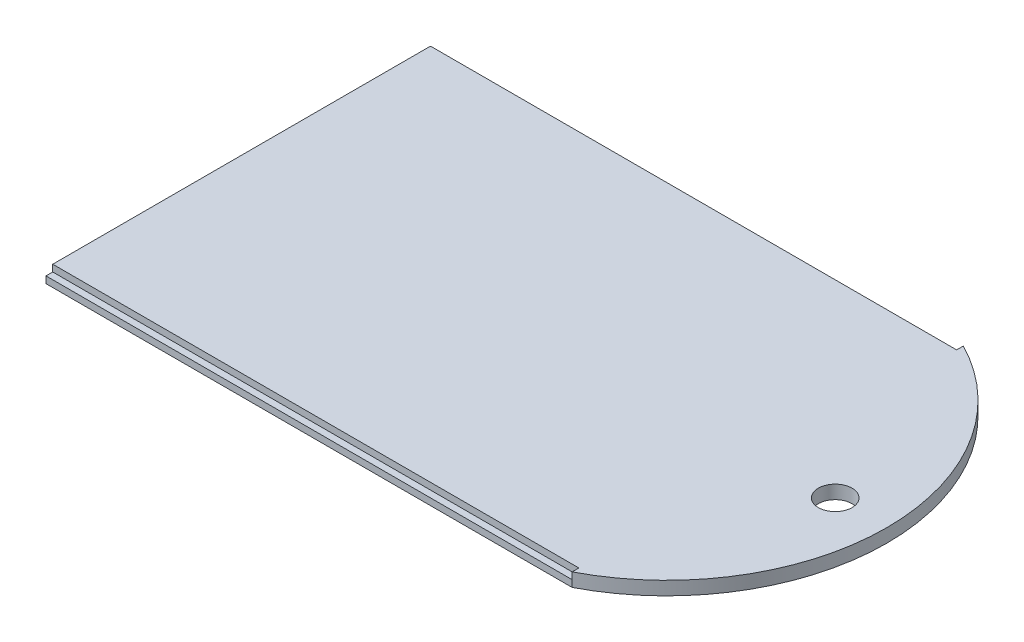
ISO-10303-21;
HEADER;
FILE_DESCRIPTION(('STEP AP214'),'2;1');
FILE_NAME('part.step','',(''),(''),'','','');
FILE_SCHEMA(('AUTOMOTIVE_DESIGN { 1 0 10303 214 1 1 1 1 }'));
ENDSEC;
DATA;
#1=APPLICATION_CONTEXT('core data for automotive mechanical design processes');
#2=APPLICATION_PROTOCOL_DEFINITION('international standard','automotive_design',2000,#1);
#3=PRODUCT_CONTEXT('',#1,'mechanical');
#4=PRODUCT('Part','Part','',(#3));
#5=PRODUCT_RELATED_PRODUCT_CATEGORY('part','',(#4));
#6=PRODUCT_DEFINITION_FORMATION('','',#4);
#7=PRODUCT_DEFINITION_CONTEXT('part definition',#1,'design');
#8=PRODUCT_DEFINITION('design','',#6,#7);
#9=PRODUCT_DEFINITION_SHAPE('','',#8);
#10=(LENGTH_UNIT() NAMED_UNIT(*) SI_UNIT(.MILLI.,.METRE.));
#11=(NAMED_UNIT(*) PLANE_ANGLE_UNIT() SI_UNIT($,.RADIAN.));
#12=(NAMED_UNIT(*) SI_UNIT($,.STERADIAN.) SOLID_ANGLE_UNIT());
#13=UNCERTAINTY_MEASURE_WITH_UNIT(LENGTH_MEASURE(1.E-05),#10,'distance_accuracy_value','');
#14=(GEOMETRIC_REPRESENTATION_CONTEXT(3) GLOBAL_UNCERTAINTY_ASSIGNED_CONTEXT((#13)) GLOBAL_UNIT_ASSIGNED_CONTEXT((#10,
#11,#12)) REPRESENTATION_CONTEXT('',''));
#15=CARTESIAN_POINT('',(0.,0.,0.));
#16=DIRECTION('',(0.,0.,1.));
#17=DIRECTION('',(1.,0.,0.));
#18=AXIS2_PLACEMENT_3D('',#15,#16,#17);
#19=CARTESIAN_POINT('',(0.,2.,-58.));
#20=DIRECTION('',(0.,0.,1.));
#21=DIRECTION('',(1.,0.,0.));
#22=AXIS2_PLACEMENT_3D('',#19,#20,#21);
#23=PLANE('',#22);
#24=DIRECTION('',(-1.,0.,0.));
#25=VECTOR('',#24,1.);
#26=CARTESIAN_POINT('',(0.,1.,-58.));
#27=LINE('',#26,#25);
#28=CARTESIAN_POINT('',(78.,1.,-58.));
#29=VERTEX_POINT('',#28);
#30=CARTESIAN_POINT('',(0.,1.,-58.));
#31=VERTEX_POINT('',#30);
#32=EDGE_CURVE('E160',#29,#31,#27,.T.);
#33=ORIENTED_EDGE('',*,*,#32,.F.);
#34=DIRECTION('',(0.,-1.,0.));
#35=VECTOR('',#34,1.);
#36=CARTESIAN_POINT('',(78.,2.,-58.));
#37=LINE('',#36,#35);
#38=CARTESIAN_POINT('',(78.,0.,-58.));
#39=VERTEX_POINT('',#38);
#40=EDGE_CURVE('E149',#29,#39,#37,.T.);
#41=ORIENTED_EDGE('',*,*,#40,.T.);
#42=DIRECTION('',(-1.,0.,0.));
#43=VECTOR('',#42,1.);
#44=CARTESIAN_POINT('',(0.,0.,-58.));
#45=LINE('',#44,#43);
#46=CARTESIAN_POINT('',(0.,0.,-58.));
#47=VERTEX_POINT('',#46);
#48=EDGE_CURVE('E145',#39,#47,#45,.T.);
#49=ORIENTED_EDGE('',*,*,#48,.T.);
#50=DIRECTION('',(0.,-1.,0.));
#51=VECTOR('',#50,1.);
#52=CARTESIAN_POINT('',(0.,2.,-58.));
#53=LINE('',#52,#51);
#54=EDGE_CURVE('E127',#31,#47,#53,.T.);
#55=ORIENTED_EDGE('',*,*,#54,.F.);
#56=EDGE_LOOP('',(#33,#41,#49,#55));
#57=FACE_BOUND('',#56,.T.);
#58=ADVANCED_FACE('F33',(#57),#23,.F.);
#59=CARTESIAN_POINT('',(63.,2.,-29.));
#60=DIRECTION('',(0.,-1.,0.));
#61=DIRECTION('',(0.,0.,-1.));
#62=AXIS2_PLACEMENT_3D('',#59,#60,#61);
#63=PLANE('',#62);
#64=DIRECTION('',(0.,0.,1.));
#65=VECTOR('',#64,1.);
#66=CARTESIAN_POINT('',(0.,2.,0.));
#67=LINE('',#66,#65);
#68=CARTESIAN_POINT('',(0.,2.,-57.));
#69=VERTEX_POINT('',#68);
#70=CARTESIAN_POINT('',(0.,2.,-1.));
#71=VERTEX_POINT('',#70);
#72=EDGE_CURVE('E147',#69,#71,#67,.T.);
#73=ORIENTED_EDGE('',*,*,#72,.T.);
#74=DIRECTION('',(-1.,0.,0.));
#75=VECTOR('',#74,1.);
#76=CARTESIAN_POINT('',(0.,2.,-1.));
#77=LINE('',#76,#75);
#78=CARTESIAN_POINT('',(78.,2.,-1.));
#79=VERTEX_POINT('',#78);
#80=EDGE_CURVE('E111',#79,#71,#77,.T.);
#81=ORIENTED_EDGE('',*,*,#80,.F.);
#82=DIRECTION('',(0.,0.,-1.));
#83=VECTOR('',#82,1.);
#84=CARTESIAN_POINT('',(78.,2.,0.));
#85=LINE('',#84,#83);
#86=CARTESIAN_POINT('',(78.,2.,0.));
#87=VERTEX_POINT('',#86);
#88=EDGE_CURVE('E180',#87,#79,#85,.T.);
#89=ORIENTED_EDGE('',*,*,#88,.F.);
#90=CARTESIAN_POINT('',(63.,2.,-29.));
#91=DIRECTION('',(0.,1.,0.));
#92=DIRECTION('',(0.,0.,-1.));
#93=AXIS2_PLACEMENT_3D('',#90,#91,#92);
#94=CIRCLE('',#93,32.649655434629);
#95=CARTESIAN_POINT('',(78.,2.,-58.));
#96=VERTEX_POINT('',#95);
#97=EDGE_CURVE('E140',#87,#96,#94,.T.);
#98=ORIENTED_EDGE('',*,*,#97,.T.);
#99=DIRECTION('',(0.,0.,-1.));
#100=VECTOR('',#99,1.);
#101=CARTESIAN_POINT('',(78.,2.,-58.));
#102=LINE('',#101,#100);
#103=CARTESIAN_POINT('',(78.,2.,-57.));
#104=VERTEX_POINT('',#103);
#105=EDGE_CURVE('E166',#104,#96,#102,.T.);
#106=ORIENTED_EDGE('',*,*,#105,.F.);
#107=DIRECTION('',(1.,0.,0.));
#108=VECTOR('',#107,1.);
#109=CARTESIAN_POINT('',(0.,2.,-57.));
#110=LINE('',#109,#108);
#111=EDGE_CURVE('E172',#69,#104,#110,.T.);
#112=ORIENTED_EDGE('',*,*,#111,.F.);
#113=EDGE_LOOP('',(#73,#81,#89,#98,#106,#112));
#114=FACE_BOUND('',#113,.T.);
#115=CARTESIAN_POINT('',(88.,2.,-29.));
#116=DIRECTION('',(0.,1.,0.));
#117=DIRECTION('',(0.,0.,1.));
#118=AXIS2_PLACEMENT_3D('',#115,#116,#117);
#119=CIRCLE('',#118,2.50000000000001);
#120=CARTESIAN_POINT('',(88.,2.,-26.5));
#121=VERTEX_POINT('',#120);
#122=EDGE_CURVE('E132',#121,#121,#119,.T.);
#123=ORIENTED_EDGE('',*,*,#122,.F.);
#124=EDGE_LOOP('',(#123));
#125=FACE_BOUND('',#124,.T.);
#126=ADVANCED_FACE('F176',(#114,#125),#63,.F.);
#127=CARTESIAN_POINT('',(63.,0.,-29.));
#128=DIRECTION('',(0.,-1.,0.));
#129=DIRECTION('',(0.,0.,-1.));
#130=AXIS2_PLACEMENT_3D('',#127,#128,#129);
#131=PLANE('',#130);
#132=DIRECTION('',(0.,0.,1.));
#133=VECTOR('',#132,1.);
#134=CARTESIAN_POINT('',(0.,0.,0.));
#135=LINE('',#134,#133);
#136=CARTESIAN_POINT('',(0.,0.,0.));
#137=VERTEX_POINT('',#136);
#138=EDGE_CURVE('E124',#47,#137,#135,.T.);
#139=ORIENTED_EDGE('',*,*,#138,.F.);
#140=ORIENTED_EDGE('',*,*,#48,.F.);
#141=CARTESIAN_POINT('',(63.,0.,-29.));
#142=DIRECTION('',(0.,1.,0.));
#143=DIRECTION('',(0.,0.,-1.));
#144=AXIS2_PLACEMENT_3D('',#141,#142,#143);
#145=CIRCLE('',#144,32.649655434629);
#146=CARTESIAN_POINT('',(78.,0.,0.));
#147=VERTEX_POINT('',#146);
#148=EDGE_CURVE('E134',#147,#39,#145,.T.);
#149=ORIENTED_EDGE('',*,*,#148,.F.);
#150=DIRECTION('',(1.,0.,0.));
#151=VECTOR('',#150,1.);
#152=CARTESIAN_POINT('',(0.,0.,0.));
#153=LINE('',#152,#151);
#154=EDGE_CURVE('E131',#137,#147,#153,.T.);
#155=ORIENTED_EDGE('',*,*,#154,.F.);
#156=EDGE_LOOP('',(#139,#140,#149,#155));
#157=FACE_BOUND('',#156,.T.);
#158=CARTESIAN_POINT('',(88.,0.,-29.));
#159=DIRECTION('',(0.,1.,0.));
#160=DIRECTION('',(0.,0.,1.));
#161=AXIS2_PLACEMENT_3D('',#158,#159,#160);
#162=CIRCLE('',#161,2.50000000000001);
#163=CARTESIAN_POINT('',(88.,0.,-26.5));
#164=VERTEX_POINT('',#163);
#165=EDGE_CURVE('E137',#164,#164,#162,.T.);
#166=ORIENTED_EDGE('',*,*,#165,.T.);
#167=EDGE_LOOP('',(#166));
#168=FACE_BOUND('',#167,.T.);
#169=ADVANCED_FACE('F156',(#157,#168),#131,.T.);
#170=CARTESIAN_POINT('',(0.,2.,0.));
#171=DIRECTION('',(1.,0.,0.));
#172=DIRECTION('',(0.,0.,-1.));
#173=AXIS2_PLACEMENT_3D('',#170,#171,#172);
#174=PLANE('',#173);
#175=DIRECTION('',(0.,0.,1.));
#176=VECTOR('',#175,1.);
#177=CARTESIAN_POINT('',(0.,1.,0.));
#178=LINE('',#177,#176);
#179=CARTESIAN_POINT('',(0.,1.,-1.));
#180=VERTEX_POINT('',#179);
#181=CARTESIAN_POINT('',(0.,1.,0.));
#182=VERTEX_POINT('',#181);
#183=EDGE_CURVE('E104',#180,#182,#178,.T.);
#184=ORIENTED_EDGE('',*,*,#183,.F.);
#185=DIRECTION('',(0.,1.,0.));
#186=VECTOR('',#185,1.);
#187=CARTESIAN_POINT('',(0.,1.,-1.));
#188=LINE('',#187,#186);
#189=EDGE_CURVE('E189',#180,#71,#188,.T.);
#190=ORIENTED_EDGE('',*,*,#189,.T.);
#191=ORIENTED_EDGE('',*,*,#72,.F.);
#192=DIRECTION('',(0.,1.,0.));
#193=VECTOR('',#192,1.);
#194=CARTESIAN_POINT('',(0.,1.,-57.));
#195=LINE('',#194,#193);
#196=CARTESIAN_POINT('',(0.,1.,-57.));
#197=VERTEX_POINT('',#196);
#198=EDGE_CURVE('E185',#197,#69,#195,.T.);
#199=ORIENTED_EDGE('',*,*,#198,.F.);
#200=DIRECTION('',(0.,0.,1.));
#201=VECTOR('',#200,1.);
#202=CARTESIAN_POINT('',(0.,1.,-58.));
#203=LINE('',#202,#201);
#204=EDGE_CURVE('E171',#31,#197,#203,.T.);
#205=ORIENTED_EDGE('',*,*,#204,.F.);
#206=ORIENTED_EDGE('',*,*,#54,.T.);
#207=ORIENTED_EDGE('',*,*,#138,.T.);
#208=DIRECTION('',(0.,-1.,0.));
#209=VECTOR('',#208,1.);
#210=CARTESIAN_POINT('',(0.,2.,0.));
#211=LINE('',#210,#209);
#212=EDGE_CURVE('E11',#182,#137,#211,.T.);
#213=ORIENTED_EDGE('',*,*,#212,.F.);
#214=EDGE_LOOP('',(#184,#190,#191,#199,#205,#206,#207,#213));
#215=FACE_BOUND('',#214,.T.);
#216=ADVANCED_FACE('F35',(#215),#174,.F.);
#217=CARTESIAN_POINT('',(0.,2.,0.));
#218=DIRECTION('',(0.,0.,-1.));
#219=DIRECTION('',(-1.,0.,0.));
#220=AXIS2_PLACEMENT_3D('',#217,#218,#219);
#221=PLANE('',#220);
#222=DIRECTION('',(0.,-1.,0.));
#223=VECTOR('',#222,1.);
#224=CARTESIAN_POINT('',(78.,2.,0.));
#225=LINE('',#224,#223);
#226=CARTESIAN_POINT('',(78.,1.,0.));
#227=VERTEX_POINT('',#226);
#228=EDGE_CURVE('E118',#227,#147,#225,.T.);
#229=ORIENTED_EDGE('',*,*,#228,.F.);
#230=DIRECTION('',(1.,0.,0.));
#231=VECTOR('',#230,1.);
#232=CARTESIAN_POINT('',(0.,1.,0.));
#233=LINE('',#232,#231);
#234=EDGE_CURVE('E48',#182,#227,#233,.T.);
#235=ORIENTED_EDGE('',*,*,#234,.F.);
#236=ORIENTED_EDGE('',*,*,#212,.T.);
#237=ORIENTED_EDGE('',*,*,#154,.T.);
#238=EDGE_LOOP('',(#229,#235,#236,#237));
#239=FACE_BOUND('',#238,.T.);
#240=ADVANCED_FACE('F115',(#239),#221,.F.);
#241=CARTESIAN_POINT('',(63.,2.,-29.));
#242=DIRECTION('',(0.,-1.,0.));
#243=DIRECTION('',(0.,0.,-1.));
#244=AXIS2_PLACEMENT_3D('',#241,#242,#243);
#245=CYLINDRICAL_SURFACE('',#244,32.649655434629);
#246=ORIENTED_EDGE('',*,*,#148,.T.);
#247=ORIENTED_EDGE('',*,*,#40,.F.);
#248=EDGE_CURVE('E150',#96,#29,#37,.T.);
#249=ORIENTED_EDGE('',*,*,#248,.F.);
#250=ORIENTED_EDGE('',*,*,#97,.F.);
#251=EDGE_CURVE('E41',#87,#227,#225,.T.);
#252=ORIENTED_EDGE('',*,*,#251,.T.);
#253=ORIENTED_EDGE('',*,*,#228,.T.);
#254=EDGE_LOOP('',(#246,#247,#249,#250,#252,#253));
#255=FACE_BOUND('',#254,.T.);
#256=ADVANCED_FACE('F153',(#255),#245,.T.);
#257=CARTESIAN_POINT('',(88.,2.,-29.));
#258=DIRECTION('',(0.,-1.,0.));
#259=DIRECTION('',(0.,0.,-1.));
#260=AXIS2_PLACEMENT_3D('',#257,#258,#259);
#261=CYLINDRICAL_SURFACE('',#260,2.50000000000001);
#262=ORIENTED_EDGE('',*,*,#122,.T.);
#263=EDGE_LOOP('',(#262));
#264=FACE_BOUND('',#263,.T.);
#265=ORIENTED_EDGE('',*,*,#165,.F.);
#266=EDGE_LOOP('',(#265));
#267=FACE_BOUND('',#266,.T.);
#268=ADVANCED_FACE('F229',(#264,#267),#261,.F.);
#269=CARTESIAN_POINT('',(78.,1.,-58.));
#270=DIRECTION('',(1.,0.,0.));
#271=DIRECTION('',(0.,0.,-1.));
#272=AXIS2_PLACEMENT_3D('',#269,#270,#271);
#273=PLANE('',#272);
#274=ORIENTED_EDGE('',*,*,#105,.T.);
#275=ORIENTED_EDGE('',*,*,#248,.T.);
#276=DIRECTION('',(0.,0.,-1.));
#277=VECTOR('',#276,1.);
#278=CARTESIAN_POINT('',(78.,1.,-58.));
#279=LINE('',#278,#277);
#280=CARTESIAN_POINT('',(78.,1.,-57.));
#281=VERTEX_POINT('',#280);
#282=EDGE_CURVE('E56',#281,#29,#279,.T.);
#283=ORIENTED_EDGE('',*,*,#282,.F.);
#284=DIRECTION('',(0.,1.,0.));
#285=VECTOR('',#284,1.);
#286=CARTESIAN_POINT('',(78.,1.,-57.));
#287=LINE('',#286,#285);
#288=EDGE_CURVE('E167',#281,#104,#287,.T.);
#289=ORIENTED_EDGE('',*,*,#288,.T.);
#290=EDGE_LOOP('',(#274,#275,#283,#289));
#291=FACE_BOUND('',#290,.T.);
#292=ADVANCED_FACE('F164',(#291),#273,.F.);
#293=CARTESIAN_POINT('',(0.,1.,-57.));
#294=DIRECTION('',(0.,0.,1.));
#295=DIRECTION('',(1.,0.,0.));
#296=AXIS2_PLACEMENT_3D('',#293,#294,#295);
#297=PLANE('',#296);
#298=ORIENTED_EDGE('',*,*,#111,.T.);
#299=ORIENTED_EDGE('',*,*,#288,.F.);
#300=DIRECTION('',(1.,0.,0.));
#301=VECTOR('',#300,1.);
#302=CARTESIAN_POINT('',(0.,1.,-57.));
#303=LINE('',#302,#301);
#304=EDGE_CURVE('E192',#197,#281,#303,.T.);
#305=ORIENTED_EDGE('',*,*,#304,.F.);
#306=ORIENTED_EDGE('',*,*,#198,.T.);
#307=EDGE_LOOP('',(#298,#299,#305,#306));
#308=FACE_BOUND('',#307,.T.);
#309=ADVANCED_FACE('F207',(#308),#297,.F.);
#310=CARTESIAN_POINT('',(0.,1.,0.));
#311=DIRECTION('',(0.,1.,0.));
#312=DIRECTION('',(0.,0.,1.));
#313=AXIS2_PLACEMENT_3D('',#310,#311,#312);
#314=PLANE('',#313);
#315=ORIENTED_EDGE('',*,*,#204,.T.);
#316=ORIENTED_EDGE('',*,*,#304,.T.);
#317=ORIENTED_EDGE('',*,*,#282,.T.);
#318=ORIENTED_EDGE('',*,*,#32,.T.);
#319=EDGE_LOOP('',(#315,#316,#317,#318));
#320=FACE_BOUND('',#319,.T.);
#321=ADVANCED_FACE('F208',(#320),#314,.T.);
#322=CARTESIAN_POINT('',(0.,1.,-1.));
#323=DIRECTION('',(0.,0.,-1.));
#324=DIRECTION('',(-1.,0.,0.));
#325=AXIS2_PLACEMENT_3D('',#322,#323,#324);
#326=PLANE('',#325);
#327=ORIENTED_EDGE('',*,*,#80,.T.);
#328=ORIENTED_EDGE('',*,*,#189,.F.);
#329=DIRECTION('',(-1.,0.,0.));
#330=VECTOR('',#329,1.);
#331=CARTESIAN_POINT('',(0.,1.,-1.));
#332=LINE('',#331,#330);
#333=CARTESIAN_POINT('',(78.,1.,-1.));
#334=VERTEX_POINT('',#333);
#335=EDGE_CURVE('E107',#334,#180,#332,.T.);
#336=ORIENTED_EDGE('',*,*,#335,.F.);
#337=DIRECTION('',(0.,1.,0.));
#338=VECTOR('',#337,1.);
#339=CARTESIAN_POINT('',(78.,1.,-1.));
#340=LINE('',#339,#338);
#341=EDGE_CURVE('E196',#334,#79,#340,.T.);
#342=ORIENTED_EDGE('',*,*,#341,.T.);
#343=EDGE_LOOP('',(#327,#328,#336,#342));
#344=FACE_BOUND('',#343,.T.);
#345=ADVANCED_FACE('F204',(#344),#326,.F.);
#346=CARTESIAN_POINT('',(78.,1.,0.));
#347=DIRECTION('',(1.,0.,0.));
#348=DIRECTION('',(0.,0.,-1.));
#349=AXIS2_PLACEMENT_3D('',#346,#347,#348);
#350=PLANE('',#349);
#351=ORIENTED_EDGE('',*,*,#88,.T.);
#352=ORIENTED_EDGE('',*,*,#341,.F.);
#353=DIRECTION('',(0.,0.,-1.));
#354=VECTOR('',#353,1.);
#355=CARTESIAN_POINT('',(78.,1.,0.));
#356=LINE('',#355,#354);
#357=EDGE_CURVE('E120',#227,#334,#356,.T.);
#358=ORIENTED_EDGE('',*,*,#357,.F.);
#359=ORIENTED_EDGE('',*,*,#251,.F.);
#360=EDGE_LOOP('',(#351,#352,#358,#359));
#361=FACE_BOUND('',#360,.T.);
#362=ADVANCED_FACE('F215',(#361),#350,.F.);
#363=CARTESIAN_POINT('',(0.,1.,0.));
#364=DIRECTION('',(0.,-1.,0.));
#365=DIRECTION('',(0.,0.,-1.));
#366=AXIS2_PLACEMENT_3D('',#363,#364,#365);
#367=PLANE('',#366);
#368=ORIENTED_EDGE('',*,*,#183,.T.);
#369=ORIENTED_EDGE('',*,*,#234,.T.);
#370=ORIENTED_EDGE('',*,*,#357,.T.);
#371=ORIENTED_EDGE('',*,*,#335,.T.);
#372=EDGE_LOOP('',(#368,#369,#370,#371));
#373=FACE_BOUND('',#372,.T.);
#374=ADVANCED_FACE('F105',(#373),#367,.F.);
#375=CLOSED_SHELL('',(#58,#126,#169,#216,#240,#256,#268,#292,#309,#321,#345,#362,#374));
#376=MANIFOLD_SOLID_BREP('B2',#375);
#377=ADVANCED_BREP_SHAPE_REPRESENTATION('',(#18,#376),#14);
#378=SHAPE_DEFINITION_REPRESENTATION(#9,#377);
ENDSEC;
END-ISO-10303-21;
